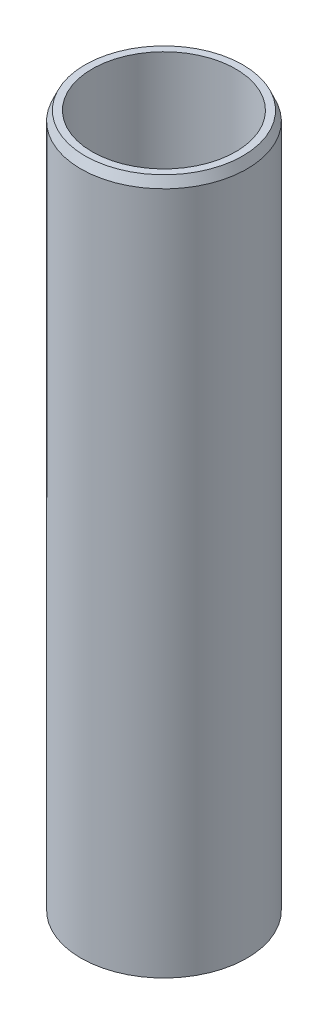
ISO-10303-21;
HEADER;
FILE_DESCRIPTION(('STEP AP214'),'2;1');
FILE_NAME('part.step','',(''),(''),'','','');
FILE_SCHEMA(('AUTOMOTIVE_DESIGN { 1 0 10303 214 1 1 1 1 }'));
ENDSEC;
DATA;
#1=APPLICATION_CONTEXT('core data for automotive mechanical design processes');
#2=APPLICATION_PROTOCOL_DEFINITION('international standard','automotive_design',2000,#1);
#3=PRODUCT_CONTEXT('',#1,'mechanical');
#4=PRODUCT('Part','Part','',(#3));
#5=PRODUCT_RELATED_PRODUCT_CATEGORY('part','',(#4));
#6=PRODUCT_DEFINITION_FORMATION('','',#4);
#7=PRODUCT_DEFINITION_CONTEXT('part definition',#1,'design');
#8=PRODUCT_DEFINITION('design','',#6,#7);
#9=PRODUCT_DEFINITION_SHAPE('','',#8);
#10=(LENGTH_UNIT() NAMED_UNIT(*) SI_UNIT(.MILLI.,.METRE.));
#11=(NAMED_UNIT(*) PLANE_ANGLE_UNIT() SI_UNIT($,.RADIAN.));
#12=(NAMED_UNIT(*) SI_UNIT($,.STERADIAN.) SOLID_ANGLE_UNIT());
#13=UNCERTAINTY_MEASURE_WITH_UNIT(LENGTH_MEASURE(1.E-05),#10,'distance_accuracy_value','');
#14=(GEOMETRIC_REPRESENTATION_CONTEXT(3) GLOBAL_UNCERTAINTY_ASSIGNED_CONTEXT((#13)) GLOBAL_UNIT_ASSIGNED_CONTEXT((#10,
#11,#12)) REPRESENTATION_CONTEXT('',''));
#15=CARTESIAN_POINT('',(0.,0.,0.));
#16=DIRECTION('',(0.,0.,1.));
#17=DIRECTION('',(1.,0.,0.));
#18=AXIS2_PLACEMENT_3D('',#15,#16,#17);
#19=CARTESIAN_POINT('',(0.,440.62650246288,0.));
#20=DIRECTION('',(0.,-1.,0.));
#21=DIRECTION('',(0.,0.,-1.));
#22=AXIS2_PLACEMENT_3D('',#19,#20,#21);
#23=CYLINDRICAL_SURFACE('',#22,52.5);
#24=CARTESIAN_POINT('',(0.,434.742344243553,0.));
#25=DIRECTION('',(0.,1.,0.));
#26=DIRECTION('',(0.,0.,1.));
#27=AXIS2_PLACEMENT_3D('',#24,#25,#26);
#28=CIRCLE('',#27,52.5);
#29=CARTESIAN_POINT('',(0.,434.742344243553,52.5));
#30=VERTEX_POINT('',#29);
#31=EDGE_CURVE('E50',#30,#30,#28,.F.);
#32=ORIENTED_EDGE('',*,*,#31,.T.);
#33=EDGE_LOOP('',(#32));
#34=FACE_BOUND('',#33,.T.);
#35=CARTESIAN_POINT('',(0.,2.58934388862153,0.));
#36=DIRECTION('',(0.,1.,0.));
#37=DIRECTION('',(0.,0.,1.));
#38=AXIS2_PLACEMENT_3D('',#35,#36,#37);
#39=CIRCLE('',#38,52.5);
#40=CARTESIAN_POINT('',(0.,2.58934388862153,52.5));
#41=VERTEX_POINT('',#40);
#42=EDGE_CURVE('E51',#41,#41,#39,.T.);
#43=ORIENTED_EDGE('',*,*,#42,.T.);
#44=EDGE_LOOP('',(#43));
#45=FACE_BOUND('',#44,.T.);
#46=ADVANCED_FACE('F39',(#34,#45),#23,.T.);
#47=CARTESIAN_POINT('',(0.,440.62650246288,0.));
#48=DIRECTION('',(0.,1.,0.));
#49=DIRECTION('',(0.,0.,1.));
#50=AXIS2_PLACEMENT_3D('',#47,#48,#49);
#51=PLANE('',#50);
#52=CARTESIAN_POINT('',(0.,440.62650246288,0.));
#53=DIRECTION('',(0.,1.,0.));
#54=DIRECTION('',(0.,0.,1.));
#55=AXIS2_PLACEMENT_3D('',#52,#53,#54);
#56=CIRCLE('',#55,49.9106561113785);
#57=CARTESIAN_POINT('',(0.,440.62650246288,49.9106561113785));
#58=VERTEX_POINT('',#57);
#59=EDGE_CURVE('E54',#58,#58,#56,.T.);
#60=ORIENTED_EDGE('',*,*,#59,.T.);
#61=EDGE_LOOP('',(#60));
#62=FACE_BOUND('',#61,.T.);
#63=CARTESIAN_POINT('',(0.,440.62650246288,0.));
#64=DIRECTION('',(0.,1.,0.));
#65=DIRECTION('',(0.,0.,1.));
#66=AXIS2_PLACEMENT_3D('',#63,#64,#65);
#67=CIRCLE('',#66,45.3939631125234);
#68=CARTESIAN_POINT('',(0.,440.62650246288,45.3939631125234));
#69=VERTEX_POINT('',#68);
#70=EDGE_CURVE('E58',#69,#69,#67,.T.);
#71=ORIENTED_EDGE('',*,*,#70,.F.);
#72=EDGE_LOOP('',(#71));
#73=FACE_BOUND('',#72,.T.);
#74=ADVANCED_FACE('F69',(#62,#73),#51,.T.);
#75=CARTESIAN_POINT('',(0.,0.,0.));
#76=DIRECTION('',(0.,1.,0.));
#77=DIRECTION('',(0.,0.,1.));
#78=AXIS2_PLACEMENT_3D('',#75,#76,#77);
#79=PLANE('',#78);
#80=CARTESIAN_POINT('',(0.,0.,0.));
#81=DIRECTION('',(0.,1.,0.));
#82=DIRECTION('',(0.,0.,1.));
#83=AXIS2_PLACEMENT_3D('',#80,#81,#82);
#84=CIRCLE('',#83,46.6158417806731);
#85=CARTESIAN_POINT('',(0.,0.,46.6158417806731));
#86=VERTEX_POINT('',#85);
#87=EDGE_CURVE('E10',#86,#86,#84,.F.);
#88=ORIENTED_EDGE('',*,*,#87,.T.);
#89=EDGE_LOOP('',(#88));
#90=FACE_BOUND('',#89,.T.);
#91=CARTESIAN_POINT('',(0.,0.,0.));
#92=DIRECTION('',(0.,1.,0.));
#93=DIRECTION('',(0.,0.,1.));
#94=AXIS2_PLACEMENT_3D('',#91,#92,#93);
#95=CIRCLE('',#94,45.3939631125234);
#96=CARTESIAN_POINT('',(0.,0.,45.3939631125234));
#97=VERTEX_POINT('',#96);
#98=EDGE_CURVE('E63',#97,#97,#95,.T.);
#99=ORIENTED_EDGE('',*,*,#98,.T.);
#100=EDGE_LOOP('',(#99));
#101=FACE_BOUND('',#100,.T.);
#102=ADVANCED_FACE('F75',(#90,#101),#79,.F.);
#103=CARTESIAN_POINT('',(0.,440.62650246288,0.));
#104=DIRECTION('',(0.,-1.,0.));
#105=DIRECTION('',(0.,0.,-1.));
#106=AXIS2_PLACEMENT_3D('',#103,#104,#105);
#107=CYLINDRICAL_SURFACE('',#106,45.3939631125234);
#108=ORIENTED_EDGE('',*,*,#70,.T.);
#109=EDGE_LOOP('',(#108));
#110=FACE_BOUND('',#109,.T.);
#111=ORIENTED_EDGE('',*,*,#98,.F.);
#112=EDGE_LOOP('',(#111));
#113=FACE_BOUND('',#112,.T.);
#114=ADVANCED_FACE('F70',(#110,#113),#107,.F.);
#115=CARTESIAN_POINT('',(0.,440.62650246288,0.));
#116=DIRECTION('',(0.,-1.,0.));
#117=DIRECTION('',(0.,0.,-1.));
#118=AXIS2_PLACEMENT_3D('',#115,#116,#117);
#119=CONICAL_SURFACE('',#118,49.9106561113785,0.414551620577641);
#120=ORIENTED_EDGE('',*,*,#31,.F.);
#121=EDGE_LOOP('',(#120));
#122=FACE_BOUND('',#121,.T.);
#123=ORIENTED_EDGE('',*,*,#59,.F.);
#124=EDGE_LOOP('',(#123));
#125=FACE_BOUND('',#124,.T.);
#126=ADVANCED_FACE('F81',(#122,#125),#119,.T.);
#127=CARTESIAN_POINT('',(0.,2.58934388862153,0.));
#128=DIRECTION('',(0.,1.,0.));
#129=DIRECTION('',(0.,0.,1.));
#130=AXIS2_PLACEMENT_3D('',#127,#128,#129);
#131=CONICAL_SURFACE('',#130,52.5,1.15624470621725);
#132=ORIENTED_EDGE('',*,*,#87,.F.);
#133=EDGE_LOOP('',(#132));
#134=FACE_BOUND('',#133,.T.);
#135=ORIENTED_EDGE('',*,*,#42,.F.);
#136=EDGE_LOOP('',(#135));
#137=FACE_BOUND('',#136,.T.);
#138=ADVANCED_FACE('F45',(#134,#137),#131,.T.);
#139=CLOSED_SHELL('',(#46,#74,#102,#114,#126,#138));
#140=MANIFOLD_SOLID_BREP('B2',#139);
#141=ADVANCED_BREP_SHAPE_REPRESENTATION('',(#18,#140),#14);
#142=SHAPE_DEFINITION_REPRESENTATION(#9,#141);
ENDSEC;
END-ISO-10303-21;
